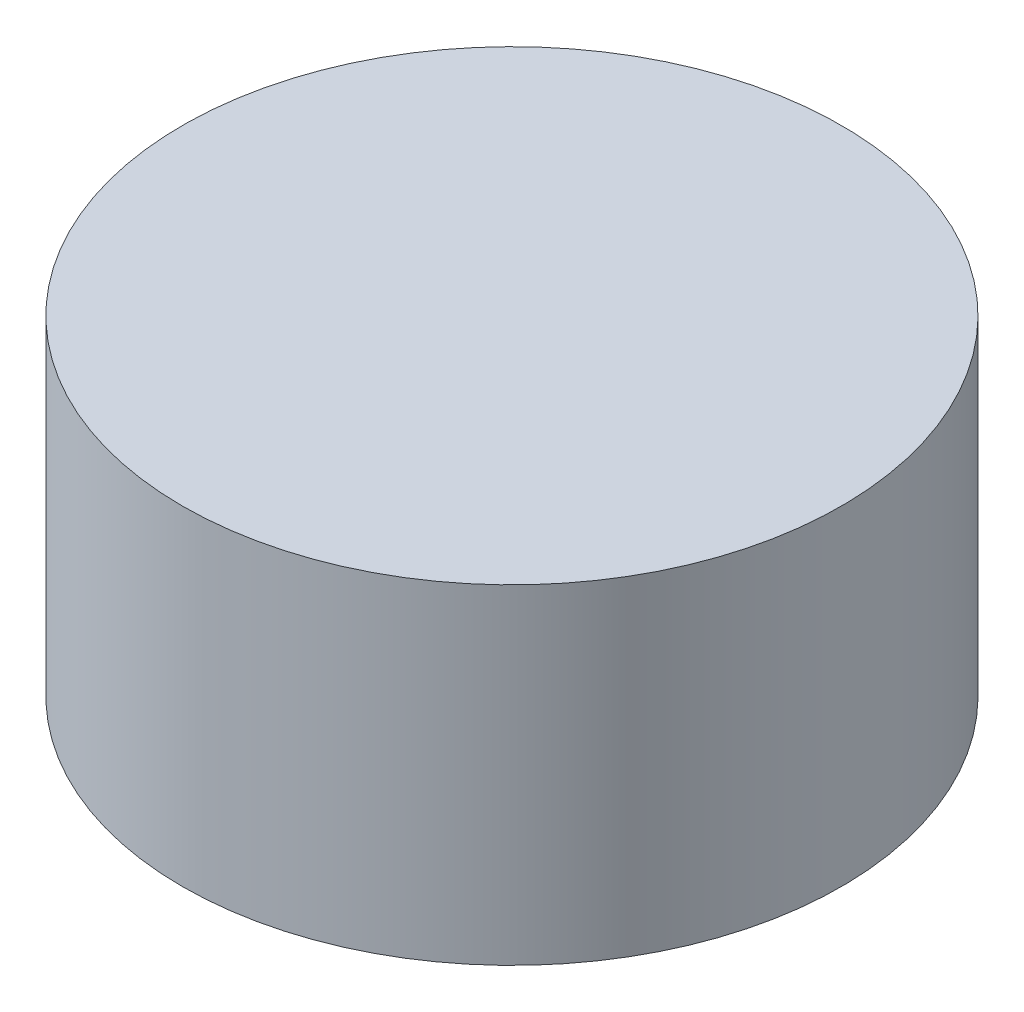
ISO-10303-21;
HEADER;
FILE_DESCRIPTION(('STEP AP214'),'2;1');
FILE_NAME('part.step','',(''),(''),'','','');
FILE_SCHEMA(('AUTOMOTIVE_DESIGN { 1 0 10303 214 1 1 1 1 }'));
ENDSEC;
DATA;
#1=APPLICATION_CONTEXT('core data for automotive mechanical design processes');
#2=APPLICATION_PROTOCOL_DEFINITION('international standard','automotive_design',2000,#1);
#3=PRODUCT_CONTEXT('',#1,'mechanical');
#4=PRODUCT('Part','Part','',(#3));
#5=PRODUCT_RELATED_PRODUCT_CATEGORY('part','',(#4));
#6=PRODUCT_DEFINITION_FORMATION('','',#4);
#7=PRODUCT_DEFINITION_CONTEXT('part definition',#1,'design');
#8=PRODUCT_DEFINITION('design','',#6,#7);
#9=PRODUCT_DEFINITION_SHAPE('','',#8);
#10=(LENGTH_UNIT() NAMED_UNIT(*) SI_UNIT(.MILLI.,.METRE.));
#11=(NAMED_UNIT(*) PLANE_ANGLE_UNIT() SI_UNIT($,.RADIAN.));
#12=(NAMED_UNIT(*) SI_UNIT($,.STERADIAN.) SOLID_ANGLE_UNIT());
#13=UNCERTAINTY_MEASURE_WITH_UNIT(LENGTH_MEASURE(1.E-05),#10,'distance_accuracy_value','');
#14=(GEOMETRIC_REPRESENTATION_CONTEXT(3) GLOBAL_UNCERTAINTY_ASSIGNED_CONTEXT((#13)) GLOBAL_UNIT_ASSIGNED_CONTEXT((#10,
#11,#12)) REPRESENTATION_CONTEXT('',''));
#15=CARTESIAN_POINT('',(0.,0.,0.));
#16=DIRECTION('',(0.,0.,1.));
#17=DIRECTION('',(1.,0.,0.));
#18=AXIS2_PLACEMENT_3D('',#15,#16,#17);
#19=CARTESIAN_POINT('',(0.,1.5,0.));
#20=DIRECTION('',(0.,-1.,0.));
#21=DIRECTION('',(0.,0.,-1.));
#22=AXIS2_PLACEMENT_3D('',#19,#20,#21);
#23=CYLINDRICAL_SURFACE('',#22,1.5);
#24=CARTESIAN_POINT('',(0.,1.5,0.));
#25=DIRECTION('',(0.,1.,0.));
#26=DIRECTION('',(0.,0.,1.));
#27=AXIS2_PLACEMENT_3D('',#24,#25,#26);
#28=CIRCLE('',#27,1.5);
#29=CARTESIAN_POINT('',(0.,1.5,1.5));
#30=VERTEX_POINT('',#29);
#31=EDGE_CURVE('E10',#30,#30,#28,.T.);
#32=ORIENTED_EDGE('',*,*,#31,.F.);
#33=EDGE_LOOP('',(#32));
#34=FACE_BOUND('',#33,.T.);
#35=CARTESIAN_POINT('',(0.,0.,0.));
#36=DIRECTION('',(0.,1.,0.));
#37=DIRECTION('',(0.,0.,1.));
#38=AXIS2_PLACEMENT_3D('',#35,#36,#37);
#39=CIRCLE('',#38,1.5);
#40=CARTESIAN_POINT('',(0.,0.,1.5));
#41=VERTEX_POINT('',#40);
#42=EDGE_CURVE('E35',#41,#41,#39,.T.);
#43=ORIENTED_EDGE('',*,*,#42,.T.);
#44=EDGE_LOOP('',(#43));
#45=FACE_BOUND('',#44,.T.);
#46=ADVANCED_FACE('F32',(#34,#45),#23,.T.);
#47=CARTESIAN_POINT('',(0.,1.5,0.));
#48=DIRECTION('',(0.,1.,0.));
#49=DIRECTION('',(0.,0.,1.));
#50=AXIS2_PLACEMENT_3D('',#47,#48,#49);
#51=PLANE('',#50);
#52=ORIENTED_EDGE('',*,*,#31,.T.);
#53=EDGE_LOOP('',(#52));
#54=FACE_BOUND('',#53,.T.);
#55=ADVANCED_FACE('F47',(#54),#51,.T.);
#56=CARTESIAN_POINT('',(0.,0.,0.));
#57=DIRECTION('',(0.,1.,0.));
#58=DIRECTION('',(0.,0.,1.));
#59=AXIS2_PLACEMENT_3D('',#56,#57,#58);
#60=PLANE('',#59);
#61=ORIENTED_EDGE('',*,*,#42,.F.);
#62=EDGE_LOOP('',(#61));
#63=FACE_BOUND('',#62,.T.);
#64=ADVANCED_FACE('F45',(#63),#60,.F.);
#65=CLOSED_SHELL('',(#46,#55,#64));
#66=MANIFOLD_SOLID_BREP('B2',#65);
#67=ADVANCED_BREP_SHAPE_REPRESENTATION('',(#18,#66),#14);
#68=SHAPE_DEFINITION_REPRESENTATION(#9,#67);
ENDSEC;
END-ISO-10303-21;
